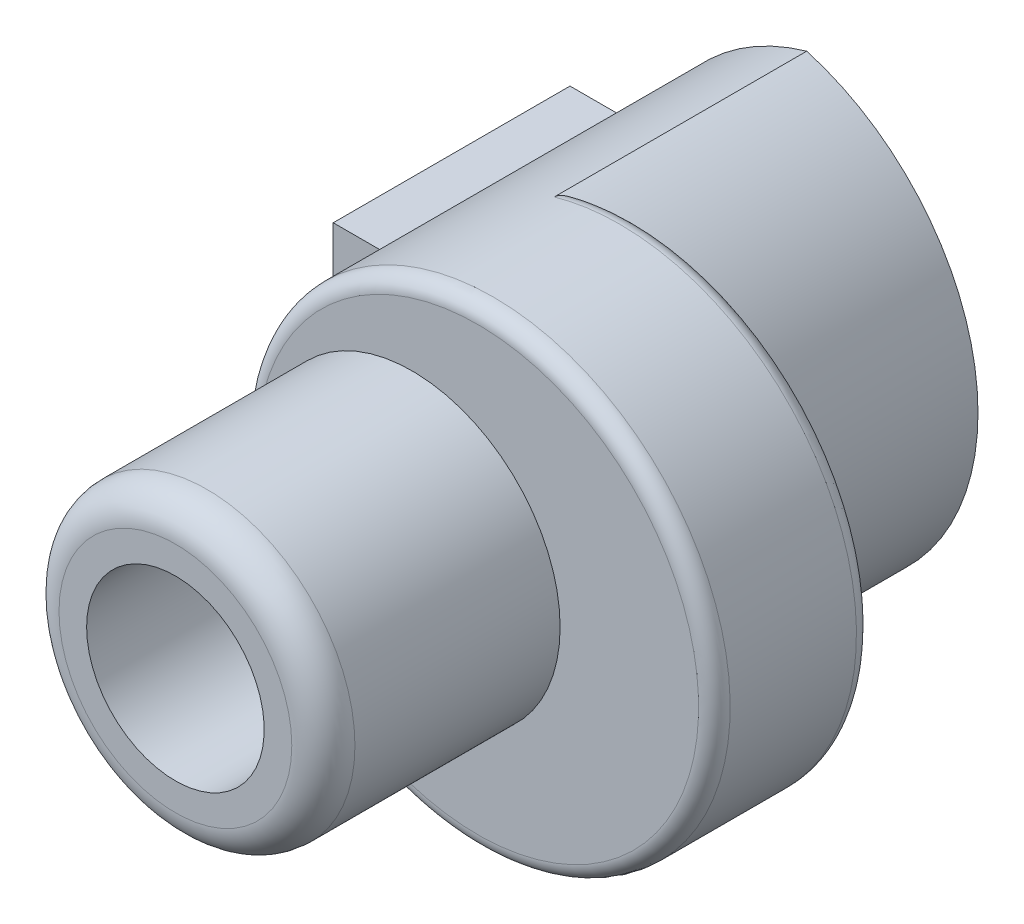
ISO-10303-21;
HEADER;
FILE_DESCRIPTION(('STEP AP214'),'2;1');
FILE_NAME('part.step','',(''),(''),'','','');
FILE_SCHEMA(('AUTOMOTIVE_DESIGN { 1 0 10303 214 1 1 1 1 }'));
ENDSEC;
DATA;
#1=APPLICATION_CONTEXT('core data for automotive mechanical design processes');
#2=APPLICATION_PROTOCOL_DEFINITION('international standard','automotive_design',2000,#1);
#3=PRODUCT_CONTEXT('',#1,'mechanical');
#4=PRODUCT('Part','Part','',(#3));
#5=PRODUCT_RELATED_PRODUCT_CATEGORY('part','',(#4));
#6=PRODUCT_DEFINITION_FORMATION('','',#4);
#7=PRODUCT_DEFINITION_CONTEXT('part definition',#1,'design');
#8=PRODUCT_DEFINITION('design','',#6,#7);
#9=PRODUCT_DEFINITION_SHAPE('','',#8);
#10=(LENGTH_UNIT() NAMED_UNIT(*) SI_UNIT(.MILLI.,.METRE.));
#11=(NAMED_UNIT(*) PLANE_ANGLE_UNIT() SI_UNIT($,.RADIAN.));
#12=(NAMED_UNIT(*) SI_UNIT($,.STERADIAN.) SOLID_ANGLE_UNIT());
#13=UNCERTAINTY_MEASURE_WITH_UNIT(LENGTH_MEASURE(1.E-05),#10,'distance_accuracy_value','');
#14=(GEOMETRIC_REPRESENTATION_CONTEXT(3) GLOBAL_UNCERTAINTY_ASSIGNED_CONTEXT((#13)) GLOBAL_UNIT_ASSIGNED_CONTEXT((#10,
#11,#12)) REPRESENTATION_CONTEXT('',''));
#15=CARTESIAN_POINT('',(0.,0.,0.));
#16=DIRECTION('',(0.,0.,1.));
#17=DIRECTION('',(1.,0.,0.));
#18=AXIS2_PLACEMENT_3D('',#15,#16,#17);
#19=CARTESIAN_POINT('',(0.,0.,62.));
#20=DIRECTION('',(0.,0.,1.));
#21=DIRECTION('',(1.,0.,0.));
#22=AXIS2_PLACEMENT_3D('',#19,#20,#21);
#23=PLANE('',#22);
#24=CARTESIAN_POINT('',(0.,0.,62.));
#25=DIRECTION('',(0.,0.,1.));
#26=DIRECTION('',(1.,0.,0.));
#27=AXIS2_PLACEMENT_3D('',#24,#25,#26);
#28=CIRCLE('',#27,2.25);
#29=CARTESIAN_POINT('',(-2.25,0.,62.));
#30=VERTEX_POINT('',#29);
#31=EDGE_CURVE('E237',#30,#30,#28,.T.);
#32=ORIENTED_EDGE('',*,*,#31,.T.);
#33=EDGE_LOOP('',(#32));
#34=FACE_BOUND('',#33,.T.);
#35=CARTESIAN_POINT('',(1.66,0.,62.));
#36=DIRECTION('',(0.,0.,-1.));
#37=DIRECTION('',(-0.276666666666667,0.960965949217534,0.));
#38=AXIS2_PLACEMENT_3D('',#35,#36,#37);
#39=CIRCLE('',#38,6.);
#40=CARTESIAN_POINT('',(0.,-5.7657956953052,62.));
#41=VERTEX_POINT('',#40);
#42=CARTESIAN_POINT('',(-3.99685423895567,-2.00000002980232,62.));
#43=VERTEX_POINT('',#42);
#44=EDGE_CURVE('E208',#41,#43,#39,.T.);
#45=ORIENTED_EDGE('',*,*,#44,.T.);
#46=DIRECTION('',(-1.,0.,0.));
#47=VECTOR('',#46,1.);
#48=CARTESIAN_POINT('',(-3.00000004470348,-2.00000002980232,62.));
#49=LINE('',#48,#47);
#50=CARTESIAN_POINT('',(-6.00000008940697,-2.00000002980232,62.));
#51=VERTEX_POINT('',#50);
#52=EDGE_CURVE('E49',#43,#51,#49,.T.);
#53=ORIENTED_EDGE('',*,*,#52,.T.);
#54=DIRECTION('',(0.,1.,0.));
#55=VECTOR('',#54,1.);
#56=CARTESIAN_POINT('',(-6.00000008940697,1.00000001490116,62.));
#57=LINE('',#56,#55);
#58=CARTESIAN_POINT('',(-6.00000008940697,2.00000002980232,62.));
#59=VERTEX_POINT('',#58);
#60=EDGE_CURVE('E212',#51,#59,#57,.T.);
#61=ORIENTED_EDGE('',*,*,#60,.T.);
#62=DIRECTION('',(1.,0.,0.));
#63=VECTOR('',#62,1.);
#64=CARTESIAN_POINT('',(-1.99842711947783,2.00000002980232,62.));
#65=LINE('',#64,#63);
#66=CARTESIAN_POINT('',(-3.99685423895567,2.00000002980232,62.));
#67=VERTEX_POINT('',#66);
#68=EDGE_CURVE('E229',#59,#67,#65,.T.);
#69=ORIENTED_EDGE('',*,*,#68,.T.);
#70=CARTESIAN_POINT('',(1.66,0.,62.));
#71=DIRECTION('',(0.,0.,-1.));
#72=DIRECTION('',(-0.276666666666667,0.960965949217534,0.));
#73=AXIS2_PLACEMENT_3D('',#70,#71,#72);
#74=CIRCLE('',#73,6.);
#75=CARTESIAN_POINT('',(0.,5.7657956953052,62.));
#76=VERTEX_POINT('',#75);
#77=EDGE_CURVE('E192',#67,#76,#74,.T.);
#78=ORIENTED_EDGE('',*,*,#77,.T.);
#79=CARTESIAN_POINT('',(-1.66,0.,62.));
#80=DIRECTION('',(0.,0.,-1.));
#81=DIRECTION('',(0.,-1.,0.));
#82=AXIS2_PLACEMENT_3D('',#79,#80,#81);
#83=CIRCLE('',#82,6.);
#84=EDGE_CURVE('E11',#76,#41,#83,.T.);
#85=ORIENTED_EDGE('',*,*,#84,.T.);
#86=EDGE_LOOP('',(#45,#53,#61,#69,#78,#85));
#87=FACE_BOUND('',#86,.T.);
#88=ADVANCED_FACE('F17',(#34,#87),#23,.F.);
#89=CARTESIAN_POINT('',(-1.66,0.,68.));
#90=DIRECTION('',(0.,0.,-1.));
#91=DIRECTION('',(0.,-1.,0.));
#92=AXIS2_PLACEMENT_3D('',#89,#90,#91);
#93=CYLINDRICAL_SURFACE('',#92,6.);
#94=DIRECTION('',(0.,0.,1.));
#95=VECTOR('',#94,1.);
#96=CARTESIAN_POINT('',(0.,5.7657956953052,68.));
#97=LINE('',#96,#95);
#98=CARTESIAN_POINT('',(0.,5.7657956953052,68.4));
#99=VERTEX_POINT('',#98);
#100=EDGE_CURVE('E191',#76,#99,#97,.T.);
#101=ORIENTED_EDGE('',*,*,#100,.T.);
#102=CARTESIAN_POINT('',(0.698795180722365,5.51689090841943,68.));
#103=CARTESIAN_POINT('',(0.674079341090501,5.52746604204914,68.0000017836883));
#104=CARTESIAN_POINT('',(0.649300155187525,5.53789755074934,68.0008058548941));
#105=CARTESIAN_POINT('',(0.602576694100667,5.55718932781133,68.0038488231078));
#106=CARTESIAN_POINT('',(0.580637869724552,5.56609123943293,68.005909976839));
#107=CARTESIAN_POINT('',(0.539704926275977,5.58236869990838,68.0109510955933));
#108=CARTESIAN_POINT('',(0.520709033021288,5.58978926540779,68.0137714911579));
#109=CARTESIAN_POINT('',(0.485752639378968,5.60323393503081,68.0198880624595));
#110=CARTESIAN_POINT('',(0.469781424126763,5.60929513421411,68.0230411346045));
#111=CARTESIAN_POINT('',(0.443351534973268,5.61924045402817,68.0289052937975));
#112=CARTESIAN_POINT('',(0.432860773500938,5.62316559593045,68.0314034654333));
#113=CARTESIAN_POINT('',(0.412289583388669,5.6307943273696,68.0366429257121));
#114=CARTESIAN_POINT('',(0.402207403564193,5.63450090119107,68.0393729619302));
#115=CARTESIAN_POINT('',(0.382463292498035,5.64169930795699,68.045053196197));
#116=CARTESIAN_POINT('',(0.372799185307768,5.64519408693091,68.0479920865934));
#117=CARTESIAN_POINT('',(0.353897596862157,5.65197117801822,68.0540659501203));
#118=CARTESIAN_POINT('',(0.344657586264509,5.65525656293443,68.0571896081613));
#119=CARTESIAN_POINT('',(0.326610656581862,5.66162009312668,68.0636100793136));
#120=CARTESIAN_POINT('',(0.317800797850985,5.66470134102994,68.0668955390934));
#121=CARTESIAN_POINT('',(0.300619866137064,5.67066276135645,68.0736174129177));
#122=CARTESIAN_POINT('',(0.29224541124379,5.67354603408994,68.0770424181244));
#123=CARTESIAN_POINT('',(0.27594023620586,5.67911870356204,68.0840219535274));
#124=CARTESIAN_POINT('',(0.268005653348762,5.68181115670002,68.0875649993811));
#125=CARTESIAN_POINT('',(0.252585169497065,5.68701105580144,68.0947605666767));
#126=CARTESIAN_POINT('',(0.245094847152668,5.68952143793219,68.0984014808234));
#127=CARTESIAN_POINT('',(0.22917756738885,5.69482701551893,68.1064760119955));
#128=CARTESIAN_POINT('',(0.220767295243281,5.69761251987474,68.1109490477739));
#129=CARTESIAN_POINT('',(0.204416491667144,5.70298962467688,68.1200837434502));
#130=CARTESIAN_POINT('',(0.196469981069622,5.70558459396678,68.1247326977375));
#131=CARTESIAN_POINT('',(0.181053262188884,5.71058385110639,68.1342019474669));
#132=CARTESIAN_POINT('',(0.173576334782173,5.71299164122767,68.1390094238181));
#133=CARTESIAN_POINT('',(0.159104424352652,5.71761970620139,68.1487780862203));
#134=CARTESIAN_POINT('',(0.1521019391496,5.71984363049013,68.1537264001293));
#135=CARTESIAN_POINT('',(0.138584103180117,5.72410805461511,68.163759616257));
#136=CARTESIAN_POINT('',(0.132060408039898,5.72615232592784,68.1688316379667));
#137=CARTESIAN_POINT('',(0.119504977655472,5.73006207546062,68.1790953045897));
#138=CARTESIAN_POINT('',(0.11346399708788,5.73193143195339,68.1842741373615));
#139=CARTESIAN_POINT('',(0.10187771437089,5.73549674371279,68.1947353891449));
#140=CARTESIAN_POINT('',(0.0963222461493251,5.73719665489149,68.2000051331786));
#141=CARTESIAN_POINT('',(0.0882819290150894,5.73964570206748,68.2080572719555));
#142=CARTESIAN_POINT('',(0.0856901887522335,5.74043331796168,68.2107218432265));
#143=CARTESIAN_POINT('',(0.0806306924365912,5.74196790046109,68.2160692418877));
#144=CARTESIAN_POINT('',(0.0781614796915686,5.74271537138536,68.2187505437785));
#145=CARTESIAN_POINT('',(0.0726230998618938,5.74438933100331,68.2249386260286));
#146=CARTESIAN_POINT('',(0.0695771622457903,5.74530806820859,68.2284683676081));
#147=CARTESIAN_POINT('',(0.0636808238624867,5.74708285386836,68.2355712865278));
#148=CARTESIAN_POINT('',(0.0608276326572378,5.74793982342815,68.2391419152723));
#149=CARTESIAN_POINT('',(0.0553176633278827,5.74959123860279,68.2463231812232));
#150=CARTESIAN_POINT('',(0.052658016891002,5.75038661995367,68.249931398896));
#151=CARTESIAN_POINT('',(0.0475359645612408,5.75191505232372,68.2571843351058));
#152=CARTESIAN_POINT('',(0.0450706303339498,5.75264904773855,68.2608267835351));
#153=CARTESIAN_POINT('',(0.0403379299576722,5.75405495849606,68.2681446739577));
#154=CARTESIAN_POINT('',(0.0380675986958131,5.75472781917003,68.2718180136417));
#155=CARTESIAN_POINT('',(0.0337255389991784,5.75601175961123,68.279194163139));
#156=CARTESIAN_POINT('',(0.0316508363481877,5.75662377687588,68.2828950560799));
#157=CARTESIAN_POINT('',(0.0277005677212749,5.75778638006604,68.2903227821761));
#158=CARTESIAN_POINT('',(0.0258220509197404,5.75833788567697,68.2940478993703));
#159=CARTESIAN_POINT('',(0.0222645828504671,5.75937986457607,68.3015205415618));
#160=CARTESIAN_POINT('',(0.0205827412236417,5.75987122869345,68.3052665639051));
#161=CARTESIAN_POINT('',(0.0174189427111077,5.76079337258432,68.3127774882323));
#162=CARTESIAN_POINT('',(0.0159341971466915,5.7612250023911,68.3165411090295));
#163=CARTESIAN_POINT('',(0.0131647963150562,5.7620281738199,68.3240837136725));
#164=CARTESIAN_POINT('',(0.0118774985839066,5.76240051212583,68.327861640601));
#165=CARTESIAN_POINT('',(0.00950308339738703,5.76308564351315,68.3354293612938));
#166=CARTESIAN_POINT('',(0.00841351633047218,5.76339916714777,68.3392183188086));
#167=CARTESIAN_POINT('',(0.00643453248781347,5.76396725830482,68.3468046335276));
#168=CARTESIAN_POINT('',(0.00554290616123202,5.76422247770322,68.3506013643277));
#169=CARTESIAN_POINT('',(0.0039596657159537,5.76467459023594,68.3581998007988));
#170=CARTESIAN_POINT('',(0.00326612780703973,5.76487204485937,68.3620010713287));
#171=CARTESIAN_POINT('',(0.00207877912346336,5.76520930805303,68.3696052042124));
#172=CARTESIAN_POINT('',(0.00158337288691755,5.76534957729565,68.3734077964429));
#173=CARTESIAN_POINT('',(0.000792013610187968,5.76557315183016,68.3810112827809));
#174=CARTESIAN_POINT('',(0.000494829123859025,5.76565680887175,68.3848120379611));
#175=CARTESIAN_POINT('',(9.90925880422623E-05,5.76576800610138,68.3924085118566));
#176=CARTESIAN_POINT('',(-2.95906154938551E-07,5.76579578260391,68.3962041836554));
#177=CARTESIAN_POINT('',(0.,5.7657956953052,68.4));
#178=B_SPLINE_CURVE_WITH_KNOTS('',3,(#102,#103,#104,#105,#106,#107,#108,#109,#110,#111,#112,
#113,#114,#115,#116,#117,#118,#119,#120,#121,#122,#123,#124,#125,#126,#127,#128,#129,#130,#131,
#132,#133,#134,#135,#136,#137,#138,#139,#140,#141,#142,#143,#144,#145,#146,#147,#148,#149,#150,
#151,#152,#153,#154,#155,#156,#157,#158,#159,#160,#161,#162,#163,#164,#165,#166,#167,#168,#169,
#170,#171,#172,#173,#174,#175,#176,#177),.UNSPECIFIED.,.F.,.F.,(4,2,2,2,2,2,2,2,2,2,2,2,2,2,2,2,
2,2,2,2,2,2,2,2,2,2,2,2,2,2,2,2,2,2,2,2,2,4),(0.,0.0806390668185232,0.151899938546403,
0.213639057332668,0.265735732633362,0.300159531348413,0.333404717538809,0.365465577074514,
0.39633734244915,0.426016308953158,0.454499962898764,0.481787127000818,0.507878129385387,
0.537644313992184,0.566332046834105,0.593951942155671,0.620517543882246,0.646045706076053,
0.670557025631683,0.694076332595673,0.705474080621948,0.716635376653929,0.730887720774613,
0.744834874990764,0.758488793446363,0.77186240064482,0.784969625811649,0.797825430161935,
0.810445824921164,0.822847877787182,0.835049705462458,0.847070449967441,0.858930236705989,
0.870650112721859,0.882251964271254,0.893758413726554,0.905192696875677,0.916578522811616),.UNSPECIFIED.);
#179=CARTESIAN_POINT('',(0.698795180722891,5.5168909084192,68.));
#180=VERTEX_POINT('',#179);
#181=EDGE_CURVE('E248',#180,#99,#178,.T.);
#182=ORIENTED_EDGE('',*,*,#181,.F.);
#183=CARTESIAN_POINT('',(-1.66,0.,68.));
#184=DIRECTION('',(0.,0.,1.));
#185=DIRECTION('',(0.,-1.,0.));
#186=AXIS2_PLACEMENT_3D('',#183,#184,#185);
#187=CIRCLE('',#186,6.);
#188=CARTESIAN_POINT('',(0.698795180722893,-5.5168909084192,68.));
#189=VERTEX_POINT('',#188);
#190=EDGE_CURVE('E177',#189,#180,#187,.T.);
#191=ORIENTED_EDGE('',*,*,#190,.F.);
#192=CARTESIAN_POINT('',(0.,-5.76579569530521,68.4));
#193=CARTESIAN_POINT('',(-2.36108696403958E-07,-5.76579576487366,68.3964139278222));
#194=CARTESIAN_POINT('',(8.82926975396115E-05,-5.76577093723796,68.3928279637594));
#195=CARTESIAN_POINT('',(0.000440966567398304,-5.76567155724669,68.3856517761167));
#196=CARTESIAN_POINT('',(0.000705773489570968,-5.76559681748633,68.3820615875813));
#197=CARTESIAN_POINT('',(0.00141102811246401,-5.76539712698396,68.3748796034231));
#198=CARTESIAN_POINT('',(0.00185245290317465,-5.7652718968879,68.3712879117931));
#199=CARTESIAN_POINT('',(0.00291057895217775,-5.76497086094153,68.3641054786026));
#200=CARTESIAN_POINT('',(0.00352855052931418,-5.76479468842584,68.3605149399354));
#201=CARTESIAN_POINT('',(0.00493946919738498,-5.76439139190327,68.3533373880382));
#202=CARTESIAN_POINT('',(0.00573395427484057,-5.76416381973545,68.3497507029125));
#203=CARTESIAN_POINT('',(0.00749754692973043,-5.76365737209891,68.3425834241524));
#204=CARTESIAN_POINT('',(0.00846842936931083,-5.76337797451674,68.3390033049511));
#205=CARTESIAN_POINT('',(0.0105844476691969,-5.76276753838289,68.3318517261957));
#206=CARTESIAN_POINT('',(0.0117315617968284,-5.76243591232523,68.3282809031675));
#207=CARTESIAN_POINT('',(0.014199651596501,-5.76172069851178,68.3211504883476));
#208=CARTESIAN_POINT('',(0.015522773877661,-5.76133646714149,68.3175917054091));
#209=CARTESIAN_POINT('',(0.0183424684200892,-5.76051573881719,68.3104879498685));
#210=CARTESIAN_POINT('',(0.0198413204351925,-5.76007855172998,68.3069439634046));
#211=CARTESIAN_POINT('',(0.0230120420377082,-5.75915162608713,68.2998723903469));
#212=CARTESIAN_POINT('',(0.0246862903137132,-5.75866116044297,68.2963459673127));
#213=CARTESIAN_POINT('',(0.0282073498761602,-5.75762741110135,68.2893121237456));
#214=CARTESIAN_POINT('',(0.0300566065042457,-5.7570833726079,68.2858060401481));
#215=CARTESIAN_POINT('',(0.0339272036789086,-5.75594223166986,68.2788154926286));
#216=CARTESIAN_POINT('',(0.035951026547916,-5.75534435542765,68.2753325315126));
#217=CARTESIAN_POINT('',(0.0401702500528127,-5.75409531625781,68.2683908629989));
#218=CARTESIAN_POINT('',(0.0423681433848684,-5.75344336855178,68.2649338141019));
#219=CARTESIAN_POINT('',(0.0469349706432115,-5.75208598598453,68.2580466160866));
#220=CARTESIAN_POINT('',(0.0493063843129879,-5.75137976253474,68.2546182689344));
#221=CARTESIAN_POINT('',(0.0542196843859633,-5.74991366290231,68.2477911513074));
#222=CARTESIAN_POINT('',(0.0567640176776658,-5.74915300085495,68.2443943131313));
#223=CARTESIAN_POINT('',(0.0620225421102678,-5.74757785427088,68.2376328454439));
#224=CARTESIAN_POINT('',(0.0647391303904852,-5.74676259145368,68.2342702632445));
#225=CARTESIAN_POINT('',(0.0698350085528152,-5.74523052067457,68.2281850628609));
#226=CARTESIAN_POINT('',(0.072197605150929,-5.74451917144394,68.2254470524675));
#227=CARTESIAN_POINT('',(0.0770459923080112,-5.74305669527961,68.2199855112592));
#228=CARTESIAN_POINT('',(0.0795333286671812,-5.74230504645779,68.217263495404));
#229=CARTESIAN_POINT('',(0.0872600880580062,-5.73996490497334,68.2090363606467));
#230=CARTESIAN_POINT('',(0.0926137719651467,-5.73833636554478,68.2036493006561));
#231=CARTESIAN_POINT('',(0.103804716995573,-5.73491338042413,68.1929504988905));
#232=CARTESIAN_POINT('',(0.109652849998516,-5.73311483457145,68.1876515120213));
#233=CARTESIAN_POINT('',(0.121830936357634,-5.72934632577084,68.1771445266131));
#234=CARTESIAN_POINT('',(0.128170812763536,-5.72737234377844,68.1719494977211));
#235=CARTESIAN_POINT('',(0.141329464601279,-5.72324813662398,68.1616672429503));
#236=CARTESIAN_POINT('',(0.148157221675599,-5.72109400524324,68.1565931154242));
#237=CARTESIAN_POINT('',(0.162288256431367,-5.71660518842653,68.1465697994438));
#238=CARTESIAN_POINT('',(0.16959962822911,-5.71426672717452,68.1416337443531));
#239=CARTESIAN_POINT('',(0.184693866372023,-5.70940568090818,68.131904243299));
#240=CARTESIAN_POINT('',(0.192483993344207,-5.7068794717559,68.1271239043847));
#241=CARTESIAN_POINT('',(0.208530985870412,-5.70163975514944,68.1177235957511));
#242=CARTESIAN_POINT('',(0.21679433271333,-5.69892277842912,68.1131166471906));
#243=CARTESIAN_POINT('',(0.23271009982841,-5.69365539160353,68.1046526079066));
#244=CARTESIAN_POINT('',(0.240349111243443,-5.69111253401844,68.1007654888035));
#245=CARTESIAN_POINT('',(0.256079849512978,-5.68584146374982,68.0930898610229));
#246=CARTESIAN_POINT('',(0.264176492739955,-5.68311005693585,68.0893136360317));
#247=CARTESIAN_POINT('',(0.28081855216795,-5.67745391678467,68.0818808262919));
#248=CARTESIAN_POINT('',(0.289368279206622,-5.67452592342166,68.0782363964687));
#249=CARTESIAN_POINT('',(0.306912095865117,-5.66846982633783,68.0710891754942));
#250=CARTESIAN_POINT('',(0.315909960429274,-5.66533845135995,68.067598440217));
#251=CARTESIAN_POINT('',(0.334344862743774,-5.65886992120814,68.0607813626296));
#252=CARTESIAN_POINT('',(0.343785186233888,-5.65552952692981,68.0574669969371));
#253=CARTESIAN_POINT('',(0.363098955373255,-5.64863823275091,68.0510260356565));
#254=CARTESIAN_POINT('',(0.372975234090806,-5.64508415621326,68.0479113516019));
#255=CARTESIAN_POINT('',(0.393154731868398,-5.63776340552775,68.0418940994513));
#256=CARTESIAN_POINT('',(0.403460389072937,-5.63399370449835,68.0390034044291));
#257=CARTESIAN_POINT('',(0.424489406382814,-5.62623619389146,68.033457591912));
#258=CARTESIAN_POINT('',(0.435214756358734,-5.62224536919813,68.0308142683721));
#259=CARTESIAN_POINT('',(0.462391277203946,-5.61207437034705,68.0245734731514));
#260=CARTESIAN_POINT('',(0.478879214491825,-5.60584950005732,68.0212079497983));
#261=CARTESIAN_POINT('',(0.514967035462129,-5.59202953548705,68.0146812906769));
#262=CARTESIAN_POINT('',(0.534579063369542,-5.58439376694273,68.0116727954373));
#263=CARTESIAN_POINT('',(0.565141832814609,-5.57227221565146,68.0077853471014));
#264=CARTESIAN_POINT('',(0.576088679612525,-5.56788618355684,68.0065529307586));
#265=CARTESIAN_POINT('',(0.598729696537393,-5.55872730178733,68.0043318341414));
#266=CARTESIAN_POINT('',(0.610423703302334,-5.55394853252796,68.003365626927));
#267=CARTESIAN_POINT('',(0.634543460003131,-5.54399843023566,68.0017434416643));
#268=CARTESIAN_POINT('',(0.646968465173452,-5.53882145490507,68.0011110920501));
#269=CARTESIAN_POINT('',(0.672533574835107,-5.52807580449468,68.0002269960149));
#270=CARTESIAN_POINT('',(0.685672426174283,-5.52250209648038,68.0000000226598));
#271=CARTESIAN_POINT('',(0.698795180724324,-5.5168909084186,68.));
#272=B_SPLINE_CURVE_WITH_KNOTS('',3,(#192,#193,#194,#195,#196,#197,#198,#199,#200,#201,#202,
#203,#204,#205,#206,#207,#208,#209,#210,#211,#212,#213,#214,#215,#216,#217,#218,#219,#220,#221,
#222,#223,#224,#225,#226,#227,#228,#229,#230,#231,#232,#233,#234,#235,#236,#237,#238,#239,#240,
#241,#242,#243,#244,#245,#246,#247,#248,#249,#250,#251,#252,#253,#254,#255,#256,#257,#258,#259,
#260,#261,#262,#263,#264,#265,#266,#267,#268,#269,#270,#271),.UNSPECIFIED.,.F.,.F.,(4,2,2,2,2,2,
2,2,2,2,2,2,2,2,2,2,2,2,2,2,2,2,2,2,2,2,2,2,2,2,2,2,2,2,2,2,2,2,2,4),(0.,0.0107568730243062,
0.0215543636212531,0.0324124330963242,0.0433506879124424,0.054388272662192,0.0655437748544182,
0.0768351431673656,0.0882796201076537,0.0998936893317279,0.111693037284007,0.123692528314283,
0.135906192074363,0.148347221758205,0.161027981631516,0.173960022276646,0.187154102034894,
0.198209733085839,0.209497824766072,0.232787802523542,0.257059869382531,0.282342307448539,
0.308658745653812,0.336028693605178,0.364468016277552,0.393989353396275,0.420805371727697,
0.4488266033159,0.478054522201972,0.508488889080183,0.540127947668045,0.572968594154891,
0.607006526722678,0.642236380700589,0.696044992122578,0.759794966956728,0.795362316851401,
0.833365541707604,0.873784858203017,0.916599234269985),.UNSPECIFIED.);
#273=CARTESIAN_POINT('',(0.,-5.7657956953052,68.4));
#274=VERTEX_POINT('',#273);
#275=EDGE_CURVE('E171',#274,#189,#272,.T.);
#276=ORIENTED_EDGE('',*,*,#275,.F.);
#277=DIRECTION('',(0.,0.,-1.));
#278=VECTOR('',#277,1.);
#279=CARTESIAN_POINT('',(0.,-5.7657956953052,68.));
#280=LINE('',#279,#278);
#281=EDGE_CURVE('E211',#274,#41,#280,.T.);
#282=ORIENTED_EDGE('',*,*,#281,.T.);
#283=ORIENTED_EDGE('',*,*,#84,.F.);
#284=EDGE_LOOP('',(#101,#182,#191,#276,#282,#283));
#285=FACE_BOUND('',#284,.T.);
#286=ADVANCED_FACE('F291',(#285),#93,.T.);
#287=CARTESIAN_POINT('',(0.,0.,-6.));
#288=DIRECTION('',(0.,0.,1.));
#289=DIRECTION('',(1.,0.,0.));
#290=AXIS2_PLACEMENT_3D('',#287,#288,#289);
#291=CYLINDRICAL_SURFACE('',#290,2.25);
#292=ORIENTED_EDGE('',*,*,#31,.F.);
#293=DIRECTION('',(0.,0.,1.));
#294=VECTOR('',#293,1.);
#295=CARTESIAN_POINT('',(-2.25,0.,-6.));
#296=LINE('',#295,#294);
#297=CARTESIAN_POINT('',(-2.25,0.,78.));
#298=VERTEX_POINT('',#297);
#299=EDGE_CURVE('E27',#30,#298,#296,.T.);
#300=ORIENTED_EDGE('',*,*,#299,.T.);
#301=CARTESIAN_POINT('',(0.,0.,78.));
#302=DIRECTION('',(0.,0.,-1.));
#303=DIRECTION('',(-1.,0.,0.));
#304=AXIS2_PLACEMENT_3D('',#301,#302,#303);
#305=CIRCLE('',#304,2.25);
#306=EDGE_CURVE('E167',#298,#298,#305,.T.);
#307=ORIENTED_EDGE('',*,*,#306,.F.);
#308=ORIENTED_EDGE('',*,*,#299,.F.);
#309=EDGE_LOOP('',(#292,#300,#307,#308));
#310=FACE_BOUND('',#309,.T.);
#311=ADVANCED_FACE('F300',(#310),#291,.F.);
#312=CARTESIAN_POINT('',(-1.66,0.,68.));
#313=DIRECTION('',(0.,0.,1.));
#314=DIRECTION('',(1.,0.,0.));
#315=AXIS2_PLACEMENT_3D('',#312,#313,#314);
#316=PLANE('',#315);
#317=DIRECTION('',(-1.,0.,0.));
#318=VECTOR('',#317,1.);
#319=CARTESIAN_POINT('',(-2.82842711947783,2.00000002980232,68.));
#320=LINE('',#319,#318);
#321=CARTESIAN_POINT('',(-3.99685423895567,2.00000002980232,68.));
#322=VERTEX_POINT('',#321);
#323=CARTESIAN_POINT('',(-6.00000008940697,2.00000002980232,68.));
#324=VERTEX_POINT('',#323);
#325=EDGE_CURVE('E226',#322,#324,#320,.T.);
#326=ORIENTED_EDGE('',*,*,#325,.T.);
#327=DIRECTION('',(0.,-1.,0.));
#328=VECTOR('',#327,1.);
#329=CARTESIAN_POINT('',(-6.00000008940697,1.00000001490116,68.));
#330=LINE('',#329,#328);
#331=CARTESIAN_POINT('',(-6.00000008940697,-2.00000002980232,68.));
#332=VERTEX_POINT('',#331);
#333=EDGE_CURVE('E217',#324,#332,#330,.T.);
#334=ORIENTED_EDGE('',*,*,#333,.T.);
#335=DIRECTION('',(1.,0.,0.));
#336=VECTOR('',#335,1.);
#337=CARTESIAN_POINT('',(-3.83000004470348,-2.00000002980232,68.));
#338=LINE('',#337,#336);
#339=CARTESIAN_POINT('',(-3.99685423895567,-2.00000002980232,68.));
#340=VERTEX_POINT('',#339);
#341=EDGE_CURVE('E232',#332,#340,#338,.T.);
#342=ORIENTED_EDGE('',*,*,#341,.T.);
#343=CARTESIAN_POINT('',(1.66,0.,68.));
#344=DIRECTION('',(0.,0.,-1.));
#345=DIRECTION('',(0.,-1.,0.));
#346=AXIS2_PLACEMENT_3D('',#343,#344,#345);
#347=CIRCLE('',#346,6.);
#348=EDGE_CURVE('E200',#340,#322,#347,.T.);
#349=ORIENTED_EDGE('',*,*,#348,.T.);
#350=EDGE_LOOP('',(#326,#334,#342,#349));
#351=FACE_BOUND('',#350,.T.);
#352=ADVANCED_FACE('F456',(#351),#316,.T.);
#353=CARTESIAN_POINT('',(-6.00000008940697,-2.00000002980232,68.));
#354=DIRECTION('',(0.,1.,0.));
#355=DIRECTION('',(1.,0.,0.));
#356=AXIS2_PLACEMENT_3D('',#353,#354,#355);
#357=PLANE('',#356);
#358=ORIENTED_EDGE('',*,*,#341,.F.);
#359=DIRECTION('',(0.,0.,-1.));
#360=VECTOR('',#359,1.);
#361=CARTESIAN_POINT('',(-6.00000008940697,-2.00000002980232,68.));
#362=LINE('',#361,#360);
#363=EDGE_CURVE('E215',#332,#51,#362,.T.);
#364=ORIENTED_EDGE('',*,*,#363,.T.);
#365=ORIENTED_EDGE('',*,*,#52,.F.);
#366=DIRECTION('',(0.,0.,-1.));
#367=VECTOR('',#366,1.);
#368=CARTESIAN_POINT('',(-3.99685423895567,-2.00000002980232,68.));
#369=LINE('',#368,#367);
#370=EDGE_CURVE('E204',#340,#43,#369,.T.);
#371=ORIENTED_EDGE('',*,*,#370,.F.);
#372=EDGE_LOOP('',(#358,#364,#365,#371));
#373=FACE_BOUND('',#372,.T.);
#374=ADVANCED_FACE('F301',(#373),#357,.F.);
#375=CARTESIAN_POINT('',(-3.99685423895567,2.00000002980232,68.));
#376=DIRECTION('',(0.,-1.,0.));
#377=DIRECTION('',(0.,0.,-1.));
#378=AXIS2_PLACEMENT_3D('',#375,#376,#377);
#379=PLANE('',#378);
#380=ORIENTED_EDGE('',*,*,#325,.F.);
#381=DIRECTION('',(0.,0.,-1.));
#382=VECTOR('',#381,1.);
#383=CARTESIAN_POINT('',(-3.99685423895567,2.00000002980232,68.));
#384=LINE('',#383,#382);
#385=EDGE_CURVE('E196',#322,#67,#384,.T.);
#386=ORIENTED_EDGE('',*,*,#385,.T.);
#387=ORIENTED_EDGE('',*,*,#68,.F.);
#388=DIRECTION('',(0.,0.,-1.));
#389=VECTOR('',#388,1.);
#390=CARTESIAN_POINT('',(-6.00000008940697,2.00000002980232,68.));
#391=LINE('',#390,#389);
#392=EDGE_CURVE('E216',#324,#59,#391,.T.);
#393=ORIENTED_EDGE('',*,*,#392,.F.);
#394=EDGE_LOOP('',(#380,#386,#387,#393));
#395=FACE_BOUND('',#394,.T.);
#396=ADVANCED_FACE('F19',(#395),#379,.F.);
#397=CARTESIAN_POINT('',(-6.00000008940697,2.00000002980232,68.));
#398=DIRECTION('',(1.,0.,0.));
#399=DIRECTION('',(0.,1.,0.));
#400=AXIS2_PLACEMENT_3D('',#397,#398,#399);
#401=PLANE('',#400);
#402=ORIENTED_EDGE('',*,*,#333,.F.);
#403=ORIENTED_EDGE('',*,*,#392,.T.);
#404=ORIENTED_EDGE('',*,*,#60,.F.);
#405=ORIENTED_EDGE('',*,*,#363,.F.);
#406=EDGE_LOOP('',(#402,#403,#404,#405));
#407=FACE_BOUND('',#406,.T.);
#408=ADVANCED_FACE('F506',(#407),#401,.F.);
#409=CARTESIAN_POINT('',(1.66,0.,72.));
#410=DIRECTION('',(0.,0.,1.));
#411=DIRECTION('',(1.,0.,0.));
#412=AXIS2_PLACEMENT_3D('',#409,#410,#411);
#413=PLANE('',#412);
#414=CARTESIAN_POINT('',(0.,0.,72.));
#415=DIRECTION('',(0.,0.,-1.));
#416=DIRECTION('',(-1.,0.,0.));
#417=AXIS2_PLACEMENT_3D('',#414,#415,#416);
#418=CIRCLE('',#417,3.75);
#419=CARTESIAN_POINT('',(3.75,0.,72.));
#420=VERTEX_POINT('',#419);
#421=EDGE_CURVE('E164',#420,#420,#418,.T.);
#422=ORIENTED_EDGE('',*,*,#421,.T.);
#423=EDGE_LOOP('',(#422));
#424=FACE_BOUND('',#423,.T.);
#425=CARTESIAN_POINT('',(1.66,0.,72.));
#426=DIRECTION('',(0.,0.,-1.));
#427=DIRECTION('',(0.,-1.,0.));
#428=AXIS2_PLACEMENT_3D('',#425,#426,#427);
#429=CIRCLE('',#428,5.6);
#430=CARTESIAN_POINT('',(-3.94,0.,72.));
#431=VERTEX_POINT('',#430);
#432=EDGE_CURVE('E172',#431,#431,#429,.T.);
#433=ORIENTED_EDGE('',*,*,#432,.F.);
#434=EDGE_LOOP('',(#433));
#435=FACE_BOUND('',#434,.T.);
#436=ADVANCED_FACE('F267',(#424,#435),#413,.T.);
#437=CARTESIAN_POINT('',(1.66,0.,68.));
#438=DIRECTION('',(0.,0.,1.));
#439=DIRECTION('',(0.,-1.,0.));
#440=AXIS2_PLACEMENT_3D('',#437,#438,#439);
#441=CYLINDRICAL_SURFACE('',#440,6.);
#442=CARTESIAN_POINT('',(1.66,0.,71.6));
#443=DIRECTION('',(0.,0.,1.));
#444=DIRECTION('',(0.,-1.,0.));
#445=AXIS2_PLACEMENT_3D('',#442,#443,#444);
#446=CIRCLE('',#445,6.);
#447=CARTESIAN_POINT('',(1.66,6.,71.6));
#448=VERTEX_POINT('',#447);
#449=CARTESIAN_POINT('',(-4.34,0.,71.6));
#450=VERTEX_POINT('',#449);
#451=EDGE_CURVE('E185',#448,#450,#446,.T.);
#452=ORIENTED_EDGE('',*,*,#451,.F.);
#453=DIRECTION('',(0.,0.,-1.));
#454=VECTOR('',#453,1.);
#455=CARTESIAN_POINT('',(1.66,6.,68.));
#456=LINE('',#455,#454);
#457=CARTESIAN_POINT('',(1.66,6.,68.4));
#458=VERTEX_POINT('',#457);
#459=EDGE_CURVE('E188',#448,#458,#456,.T.);
#460=ORIENTED_EDGE('',*,*,#459,.T.);
#461=CARTESIAN_POINT('',(1.66,0.,68.4));
#462=DIRECTION('',(0.,0.,-1.));
#463=DIRECTION('',(1.,0.,0.));
#464=AXIS2_PLACEMENT_3D('',#461,#462,#463);
#465=CIRCLE('',#464,6.);
#466=EDGE_CURVE('E326',#99,#458,#465,.T.);
#467=ORIENTED_EDGE('',*,*,#466,.F.);
#468=ORIENTED_EDGE('',*,*,#100,.F.);
#469=ORIENTED_EDGE('',*,*,#77,.F.);
#470=ORIENTED_EDGE('',*,*,#385,.F.);
#471=ORIENTED_EDGE('',*,*,#348,.F.);
#472=ORIENTED_EDGE('',*,*,#370,.T.);
#473=ORIENTED_EDGE('',*,*,#44,.F.);
#474=ORIENTED_EDGE('',*,*,#281,.F.);
#475=CARTESIAN_POINT('',(1.66,0.,68.4));
#476=DIRECTION('',(0.,0.,-1.));
#477=DIRECTION('',(1.,0.,0.));
#478=AXIS2_PLACEMENT_3D('',#475,#476,#477);
#479=CIRCLE('',#478,6.);
#480=EDGE_CURVE('E314',#458,#274,#479,.T.);
#481=ORIENTED_EDGE('',*,*,#480,.F.);
#482=ORIENTED_EDGE('',*,*,#459,.F.);
#483=CARTESIAN_POINT('',(1.66,0.,71.6));
#484=DIRECTION('',(0.,0.,1.));
#485=DIRECTION('',(0.,-1.,0.));
#486=AXIS2_PLACEMENT_3D('',#483,#484,#485);
#487=CIRCLE('',#486,6.);
#488=EDGE_CURVE('E181',#450,#448,#487,.T.);
#489=ORIENTED_EDGE('',*,*,#488,.F.);
#490=EDGE_LOOP('',(#452,#460,#467,#468,#469,#470,#471,#472,#473,#474,#481,#482,#489));
#491=FACE_BOUND('',#490,.T.);
#492=ADVANCED_FACE('F505',(#491),#441,.T.);
#493=CARTESIAN_POINT('',(1.66,0.,71.6));
#494=DIRECTION('',(0.,0.,1.));
#495=DIRECTION('',(1.,0.,0.));
#496=AXIS2_PLACEMENT_3D('',#493,#494,#495);
#497=TOROIDAL_SURFACE('',#496,5.6,0.4);
#498=ORIENTED_EDGE('',*,*,#432,.T.);
#499=CARTESIAN_POINT('',(-3.94,0.,71.6));
#500=DIRECTION('',(0.,-1.,0.));
#501=DIRECTION('',(-1.,0.,0.));
#502=AXIS2_PLACEMENT_3D('',#499,#500,#501);
#503=CIRCLE('',#502,0.4);
#504=EDGE_CURVE('E176',#431,#450,#503,.T.);
#505=ORIENTED_EDGE('',*,*,#504,.T.);
#506=ORIENTED_EDGE('',*,*,#488,.T.);
#507=ORIENTED_EDGE('',*,*,#451,.T.);
#508=ORIENTED_EDGE('',*,*,#504,.F.);
#509=EDGE_LOOP('',(#498,#505,#506,#507,#508));
#510=FACE_BOUND('',#509,.T.);
#511=ADVANCED_FACE('F515',(#510),#497,.T.);
#512=CARTESIAN_POINT('',(1.66,0.,68.));
#513=DIRECTION('',(0.,0.,1.));
#514=DIRECTION('',(1.,0.,0.));
#515=AXIS2_PLACEMENT_3D('',#512,#513,#514);
#516=PLANE('',#515);
#517=CARTESIAN_POINT('',(1.66,0.,68.));
#518=DIRECTION('',(0.,0.,1.));
#519=DIRECTION('',(1.,0.,0.));
#520=AXIS2_PLACEMENT_3D('',#517,#518,#519);
#521=CIRCLE('',#520,5.6);
#522=EDGE_CURVE('E317',#189,#180,#521,.T.);
#523=ORIENTED_EDGE('',*,*,#522,.F.);
#524=ORIENTED_EDGE('',*,*,#190,.T.);
#525=EDGE_LOOP('',(#523,#524));
#526=FACE_BOUND('',#525,.T.);
#527=ADVANCED_FACE('F265',(#526),#516,.F.);
#528=CARTESIAN_POINT('',(1.66,0.,68.4));
#529=DIRECTION('',(0.,0.,1.));
#530=DIRECTION('',(1.,0.,0.));
#531=AXIS2_PLACEMENT_3D('',#528,#529,#530);
#532=TOROIDAL_SURFACE('',#531,5.6,0.4);
#533=ORIENTED_EDGE('',*,*,#275,.T.);
#534=ORIENTED_EDGE('',*,*,#522,.T.);
#535=ORIENTED_EDGE('',*,*,#181,.T.);
#536=ORIENTED_EDGE('',*,*,#466,.T.);
#537=ORIENTED_EDGE('',*,*,#480,.T.);
#538=EDGE_LOOP('',(#533,#534,#535,#536,#537));
#539=FACE_BOUND('',#538,.T.);
#540=ADVANCED_FACE('F254',(#539),#532,.T.);
#541=CARTESIAN_POINT('',(0.,0.,78.));
#542=DIRECTION('',(0.,0.,1.));
#543=DIRECTION('',(1.,0.,0.));
#544=AXIS2_PLACEMENT_3D('',#541,#542,#543);
#545=PLANE('',#544);
#546=ORIENTED_EDGE('',*,*,#306,.T.);
#547=EDGE_LOOP('',(#546));
#548=FACE_BOUND('',#547,.T.);
#549=CARTESIAN_POINT('',(0.,0.,78.));
#550=DIRECTION('',(0.,0.,-1.));
#551=DIRECTION('',(-1.,0.,0.));
#552=AXIS2_PLACEMENT_3D('',#549,#550,#551);
#553=CIRCLE('',#552,2.95);
#554=CARTESIAN_POINT('',(-2.95,0.,78.));
#555=VERTEX_POINT('',#554);
#556=EDGE_CURVE('E142',#555,#555,#553,.T.);
#557=ORIENTED_EDGE('',*,*,#556,.F.);
#558=EDGE_LOOP('',(#557));
#559=FACE_BOUND('',#558,.T.);
#560=ADVANCED_FACE('F264',(#548,#559),#545,.T.);
#561=CARTESIAN_POINT('',(0.,0.,72.));
#562=DIRECTION('',(0.,0.,1.));
#563=DIRECTION('',(-1.,0.,0.));
#564=AXIS2_PLACEMENT_3D('',#561,#562,#563);
#565=CYLINDRICAL_SURFACE('',#564,3.75);
#566=CARTESIAN_POINT('',(0.,0.,77.2));
#567=DIRECTION('',(0.,0.,1.));
#568=DIRECTION('',(-1.,0.,0.));
#569=AXIS2_PLACEMENT_3D('',#566,#567,#568);
#570=CIRCLE('',#569,3.75);
#571=CARTESIAN_POINT('',(3.75,0.,77.2));
#572=VERTEX_POINT('',#571);
#573=CARTESIAN_POINT('',(-3.75,0.,77.2));
#574=VERTEX_POINT('',#573);
#575=EDGE_CURVE('E145',#572,#574,#570,.T.);
#576=ORIENTED_EDGE('',*,*,#575,.F.);
#577=DIRECTION('',(0.,0.,-1.));
#578=VECTOR('',#577,1.);
#579=CARTESIAN_POINT('',(3.75,0.,72.));
#580=LINE('',#579,#578);
#581=EDGE_CURVE('E160',#572,#420,#580,.T.);
#582=ORIENTED_EDGE('',*,*,#581,.T.);
#583=ORIENTED_EDGE('',*,*,#421,.F.);
#584=ORIENTED_EDGE('',*,*,#581,.F.);
#585=CARTESIAN_POINT('',(0.,0.,77.2));
#586=DIRECTION('',(0.,0.,1.));
#587=DIRECTION('',(-1.,0.,0.));
#588=AXIS2_PLACEMENT_3D('',#585,#586,#587);
#589=CIRCLE('',#588,3.75);
#590=EDGE_CURVE('E148',#574,#572,#589,.T.);
#591=ORIENTED_EDGE('',*,*,#590,.F.);
#592=EDGE_LOOP('',(#576,#582,#583,#584,#591));
#593=FACE_BOUND('',#592,.T.);
#594=ADVANCED_FACE('F465',(#593),#565,.T.);
#595=CARTESIAN_POINT('',(0.,0.,77.2));
#596=DIRECTION('',(0.,0.,1.));
#597=DIRECTION('',(1.,0.,0.));
#598=AXIS2_PLACEMENT_3D('',#595,#596,#597);
#599=TOROIDAL_SURFACE('',#598,2.95,0.8);
#600=ORIENTED_EDGE('',*,*,#556,.T.);
#601=CARTESIAN_POINT('',(-2.95,0.,77.2));
#602=DIRECTION('',(0.,-1.,0.));
#603=DIRECTION('',(-1.,0.,0.));
#604=AXIS2_PLACEMENT_3D('',#601,#602,#603);
#605=CIRCLE('',#604,0.8);
#606=EDGE_CURVE('E139',#555,#574,#605,.T.);
#607=ORIENTED_EDGE('',*,*,#606,.T.);
#608=ORIENTED_EDGE('',*,*,#590,.T.);
#609=ORIENTED_EDGE('',*,*,#575,.T.);
#610=ORIENTED_EDGE('',*,*,#606,.F.);
#611=EDGE_LOOP('',(#600,#607,#608,#609,#610));
#612=FACE_BOUND('',#611,.T.);
#613=ADVANCED_FACE('F140',(#612),#599,.T.);
#614=CLOSED_SHELL('',(#88,#286,#311,#352,#374,#396,#408,#436,#492,#511,#527,#540,#560,#594,#613));
#615=MANIFOLD_SOLID_BREP('B1',#614);
#616=ADVANCED_BREP_SHAPE_REPRESENTATION('',(#18,#615),#14);
#617=SHAPE_DEFINITION_REPRESENTATION(#9,#616);
ENDSEC;
END-ISO-10303-21;
